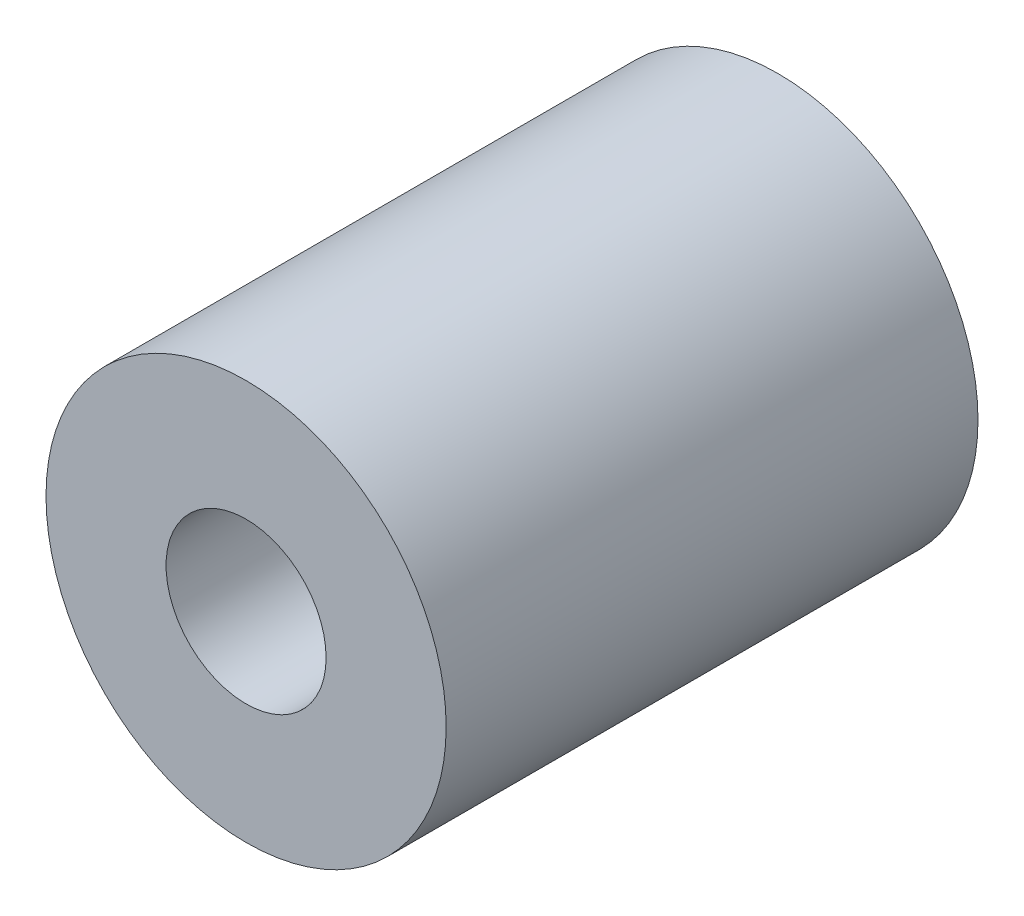
ISO-10303-21;
HEADER;
FILE_DESCRIPTION(('STEP AP214'),'2;1');
FILE_NAME('part.step','',(''),(''),'','','');
FILE_SCHEMA(('AUTOMOTIVE_DESIGN { 1 0 10303 214 1 1 1 1 }'));
ENDSEC;
DATA;
#1=APPLICATION_CONTEXT('core data for automotive mechanical design processes');
#2=APPLICATION_PROTOCOL_DEFINITION('international standard','automotive_design',2000,#1);
#3=PRODUCT_CONTEXT('',#1,'mechanical');
#4=PRODUCT('Part','Part','',(#3));
#5=PRODUCT_RELATED_PRODUCT_CATEGORY('part','',(#4));
#6=PRODUCT_DEFINITION_FORMATION('','',#4);
#7=PRODUCT_DEFINITION_CONTEXT('part definition',#1,'design');
#8=PRODUCT_DEFINITION('design','',#6,#7);
#9=PRODUCT_DEFINITION_SHAPE('','',#8);
#10=(LENGTH_UNIT() NAMED_UNIT(*) SI_UNIT(.MILLI.,.METRE.));
#11=(NAMED_UNIT(*) PLANE_ANGLE_UNIT() SI_UNIT($,.RADIAN.));
#12=(NAMED_UNIT(*) SI_UNIT($,.STERADIAN.) SOLID_ANGLE_UNIT());
#13=UNCERTAINTY_MEASURE_WITH_UNIT(LENGTH_MEASURE(1.E-05),#10,'distance_accuracy_value','');
#14=(GEOMETRIC_REPRESENTATION_CONTEXT(3) GLOBAL_UNCERTAINTY_ASSIGNED_CONTEXT((#13)) GLOBAL_UNIT_ASSIGNED_CONTEXT((#10,
#11,#12)) REPRESENTATION_CONTEXT('',''));
#15=CARTESIAN_POINT('',(0.,0.,0.));
#16=DIRECTION('',(0.,0.,1.));
#17=DIRECTION('',(1.,0.,0.));
#18=AXIS2_PLACEMENT_3D('',#15,#16,#17);
#19=CARTESIAN_POINT('',(0.,0.,7.31));
#20=DIRECTION('',(0.,0.,-1.));
#21=DIRECTION('',(-1.,0.,0.));
#22=AXIS2_PLACEMENT_3D('',#19,#20,#21);
#23=CYLINDRICAL_SURFACE('',#22,2.75);
#24=CARTESIAN_POINT('',(0.,0.,7.31));
#25=DIRECTION('',(0.,0.,1.));
#26=DIRECTION('',(1.,0.,0.));
#27=AXIS2_PLACEMENT_3D('',#24,#25,#26);
#28=CIRCLE('',#27,2.75);
#29=CARTESIAN_POINT('',(2.75,0.,7.31));
#30=VERTEX_POINT('',#29);
#31=EDGE_CURVE('E10',#30,#30,#28,.T.);
#32=ORIENTED_EDGE('',*,*,#31,.F.);
#33=EDGE_LOOP('',(#32));
#34=FACE_BOUND('',#33,.T.);
#35=CARTESIAN_POINT('',(0.,0.,0.));
#36=DIRECTION('',(0.,0.,1.));
#37=DIRECTION('',(1.,0.,0.));
#38=AXIS2_PLACEMENT_3D('',#35,#36,#37);
#39=CIRCLE('',#38,2.75);
#40=CARTESIAN_POINT('',(2.75,0.,0.));
#41=VERTEX_POINT('',#40);
#42=EDGE_CURVE('E43',#41,#41,#39,.T.);
#43=ORIENTED_EDGE('',*,*,#42,.T.);
#44=EDGE_LOOP('',(#43));
#45=FACE_BOUND('',#44,.T.);
#46=ADVANCED_FACE('F40',(#34,#45),#23,.T.);
#47=CARTESIAN_POINT('',(0.,0.,7.31));
#48=DIRECTION('',(0.,0.,1.));
#49=DIRECTION('',(1.,0.,0.));
#50=AXIS2_PLACEMENT_3D('',#47,#48,#49);
#51=PLANE('',#50);
#52=CARTESIAN_POINT('',(0.,0.,7.31));
#53=DIRECTION('',(0.,0.,1.));
#54=DIRECTION('',(1.,0.,0.));
#55=AXIS2_PLACEMENT_3D('',#52,#53,#54);
#56=CIRCLE('',#55,1.1);
#57=CARTESIAN_POINT('',(1.1,0.,7.31));
#58=VERTEX_POINT('',#57);
#59=EDGE_CURVE('E54',#58,#58,#56,.T.);
#60=ORIENTED_EDGE('',*,*,#59,.F.);
#61=EDGE_LOOP('',(#60));
#62=FACE_BOUND('',#61,.T.);
#63=ORIENTED_EDGE('',*,*,#31,.T.);
#64=EDGE_LOOP('',(#63));
#65=FACE_BOUND('',#64,.T.);
#66=ADVANCED_FACE('F60',(#62,#65),#51,.T.);
#67=CARTESIAN_POINT('',(0.,0.,0.));
#68=DIRECTION('',(0.,0.,1.));
#69=DIRECTION('',(1.,0.,0.));
#70=AXIS2_PLACEMENT_3D('',#67,#68,#69);
#71=PLANE('',#70);
#72=CARTESIAN_POINT('',(0.,0.,0.));
#73=DIRECTION('',(0.,0.,1.));
#74=DIRECTION('',(1.,0.,0.));
#75=AXIS2_PLACEMENT_3D('',#72,#73,#74);
#76=CIRCLE('',#75,1.1);
#77=CARTESIAN_POINT('',(1.1,0.,0.));
#78=VERTEX_POINT('',#77);
#79=EDGE_CURVE('E50',#78,#78,#76,.T.);
#80=ORIENTED_EDGE('',*,*,#79,.T.);
#81=EDGE_LOOP('',(#80));
#82=FACE_BOUND('',#81,.T.);
#83=ORIENTED_EDGE('',*,*,#42,.F.);
#84=EDGE_LOOP('',(#83));
#85=FACE_BOUND('',#84,.T.);
#86=ADVANCED_FACE('F62',(#82,#85),#71,.F.);
#87=CARTESIAN_POINT('',(0.,0.,7.31));
#88=DIRECTION('',(0.,0.,1.));
#89=DIRECTION('',(1.,0.,0.));
#90=AXIS2_PLACEMENT_3D('',#87,#88,#89);
#91=CYLINDRICAL_SURFACE('',#90,1.1);
#92=ORIENTED_EDGE('',*,*,#79,.F.);
#93=EDGE_LOOP('',(#92));
#94=FACE_BOUND('',#93,.T.);
#95=ORIENTED_EDGE('',*,*,#59,.T.);
#96=EDGE_LOOP('',(#95));
#97=FACE_BOUND('',#96,.T.);
#98=ADVANCED_FACE('F58',(#94,#97),#91,.F.);
#99=CLOSED_SHELL('',(#46,#66,#86,#98));
#100=MANIFOLD_SOLID_BREP('B2',#99);
#101=ADVANCED_BREP_SHAPE_REPRESENTATION('',(#18,#100),#14);
#102=SHAPE_DEFINITION_REPRESENTATION(#9,#101);
ENDSEC;
END-ISO-10303-21;
